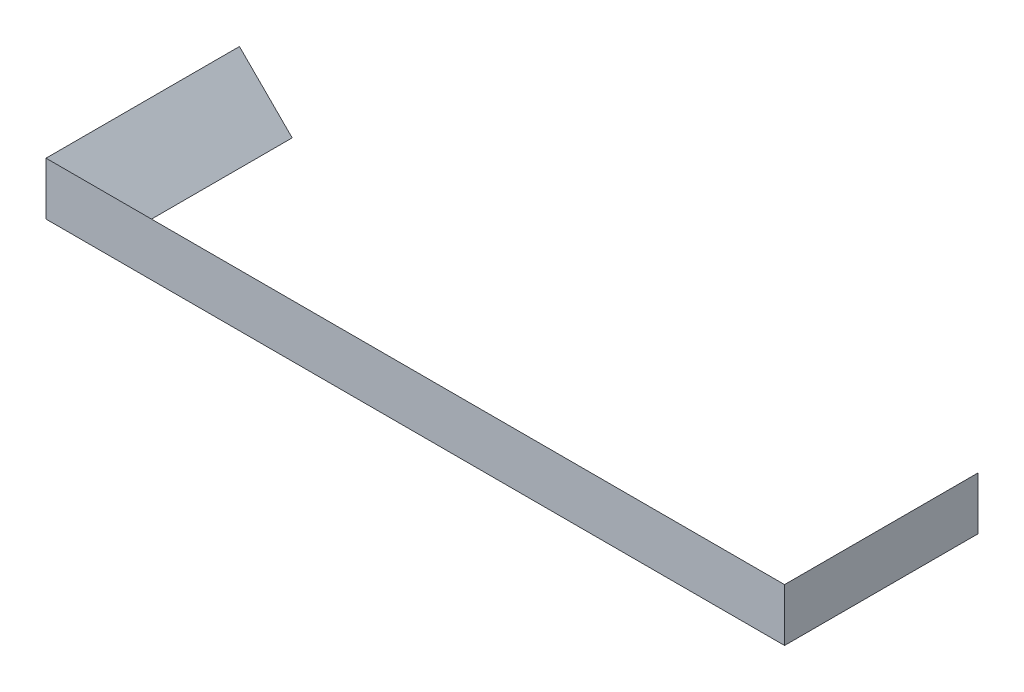
ISO-10303-21;
HEADER;
FILE_DESCRIPTION(('STEP AP214'),'2;1');
FILE_NAME('part.step','',(''),(''),'','','');
FILE_SCHEMA(('AUTOMOTIVE_DESIGN { 1 0 10303 214 1 1 1 1 }'));
ENDSEC;
DATA;
#1=APPLICATION_CONTEXT('core data for automotive mechanical design processes');
#2=APPLICATION_PROTOCOL_DEFINITION('international standard','automotive_design',2000,#1);
#3=PRODUCT_CONTEXT('',#1,'mechanical');
#4=PRODUCT('Part','Part','',(#3));
#5=PRODUCT_RELATED_PRODUCT_CATEGORY('part','',(#4));
#6=PRODUCT_DEFINITION_FORMATION('','',#4);
#7=PRODUCT_DEFINITION_CONTEXT('part definition',#1,'design');
#8=PRODUCT_DEFINITION('design','',#6,#7);
#9=PRODUCT_DEFINITION_SHAPE('','',#8);
#10=(LENGTH_UNIT() NAMED_UNIT(*) SI_UNIT(.MILLI.,.METRE.));
#11=(NAMED_UNIT(*) PLANE_ANGLE_UNIT() SI_UNIT($,.RADIAN.));
#12=(NAMED_UNIT(*) SI_UNIT($,.STERADIAN.) SOLID_ANGLE_UNIT());
#13=UNCERTAINTY_MEASURE_WITH_UNIT(LENGTH_MEASURE(1.E-05),#10,'distance_accuracy_value','');
#14=(GEOMETRIC_REPRESENTATION_CONTEXT(3) GLOBAL_UNCERTAINTY_ASSIGNED_CONTEXT((#13)) GLOBAL_UNIT_ASSIGNED_CONTEXT((#10,
#11,#12)) REPRESENTATION_CONTEXT('',''));
#15=CARTESIAN_POINT('',(0.,0.,0.));
#16=DIRECTION('',(0.,0.,1.));
#17=DIRECTION('',(1.,0.,0.));
#18=AXIS2_PLACEMENT_3D('',#15,#16,#17);
#19=CARTESIAN_POINT('',(84.,0.,22.));
#20=DIRECTION('',(-1.,0.,0.));
#21=DIRECTION('',(0.,0.,1.));
#22=AXIS2_PLACEMENT_3D('',#19,#20,#21);
#23=PLANE('',#22);
#24=DIRECTION('',(0.,-1.,0.));
#25=VECTOR('',#24,1.);
#26=CARTESIAN_POINT('',(84.,0.,0.));
#27=LINE('',#26,#25);
#28=CARTESIAN_POINT('',(84.,6.,0.));
#29=VERTEX_POINT('',#28);
#30=CARTESIAN_POINT('',(84.,0.,0.));
#31=VERTEX_POINT('',#30);
#32=EDGE_CURVE('E50',#29,#31,#27,.T.);
#33=ORIENTED_EDGE('',*,*,#32,.F.);
#34=DIRECTION('',(0.,0.,-1.));
#35=VECTOR('',#34,1.);
#36=CARTESIAN_POINT('',(84.,5.99999999999999,22.));
#37=LINE('',#36,#35);
#38=CARTESIAN_POINT('',(84.,5.99999999999999,22.));
#39=VERTEX_POINT('',#38);
#40=EDGE_CURVE('E130',#39,#29,#37,.T.);
#41=ORIENTED_EDGE('',*,*,#40,.F.);
#42=DIRECTION('',(0.,1.,0.));
#43=VECTOR('',#42,1.);
#44=CARTESIAN_POINT('',(84.,0.,22.));
#45=LINE('',#44,#43);
#46=CARTESIAN_POINT('',(84.,0.,22.));
#47=VERTEX_POINT('',#46);
#48=EDGE_CURVE('E126',#47,#39,#45,.T.);
#49=ORIENTED_EDGE('',*,*,#48,.F.);
#50=DIRECTION('',(0.,0.,-1.));
#51=VECTOR('',#50,1.);
#52=CARTESIAN_POINT('',(84.,0.,22.));
#53=LINE('',#52,#51);
#54=EDGE_CURVE('E127',#47,#31,#53,.T.);
#55=ORIENTED_EDGE('',*,*,#54,.T.);
#56=EDGE_LOOP('',(#33,#41,#49,#55));
#57=FACE_BOUND('',#56,.T.);
#58=ADVANCED_FACE('F34',(#57),#23,.F.);
#59=CARTESIAN_POINT('',(56.6094757082487,-21.3905242917513,-5.39052429175126));
#60=DIRECTION('',(0.707106781186548,-0.707106781186547,0.));
#61=DIRECTION('',(0.707106781186547,0.707106781186548,0.));
#62=AXIS2_PLACEMENT_3D('',#59,#60,#61);
#63=PLANE('',#62);
#64=DIRECTION('',(0.707106781186547,0.707106781186548,0.));
#65=VECTOR('',#64,1.);
#66=CARTESIAN_POINT('',(56.6094757082487,-21.3905242917513,0.));
#67=LINE('',#66,#65);
#68=CARTESIAN_POINT('',(78.,0.,0.));
#69=VERTEX_POINT('',#68);
#70=EDGE_CURVE('E12',#69,#29,#67,.T.);
#71=ORIENTED_EDGE('',*,*,#70,.F.);
#72=DIRECTION('',(0.,0.,-1.));
#73=VECTOR('',#72,1.);
#74=CARTESIAN_POINT('',(78.,0.,16.));
#75=LINE('',#74,#73);
#76=CARTESIAN_POINT('',(78.,0.,16.));
#77=VERTEX_POINT('',#76);
#78=EDGE_CURVE('E133',#77,#69,#75,.T.);
#79=ORIENTED_EDGE('',*,*,#78,.F.);
#80=DIRECTION('',(-0.577350269189626,-0.577350269189626,-0.577350269189626));
#81=VECTOR('',#80,1.);
#82=CARTESIAN_POINT('',(56.6094757082487,-21.3905242917513,-5.39052429175126));
#83=LINE('',#82,#81);
#84=EDGE_CURVE('E131',#39,#77,#83,.T.);
#85=ORIENTED_EDGE('',*,*,#84,.F.);
#86=ORIENTED_EDGE('',*,*,#40,.T.);
#87=EDGE_LOOP('',(#71,#79,#85,#86));
#88=FACE_BOUND('',#87,.T.);
#89=ADVANCED_FACE('F36',(#88),#63,.F.);
#90=CARTESIAN_POINT('',(0.,0.,22.));
#91=DIRECTION('',(0.,0.,1.));
#92=DIRECTION('',(1.,0.,0.));
#93=AXIS2_PLACEMENT_3D('',#90,#91,#92);
#94=PLANE('',#93);
#95=DIRECTION('',(1.,0.,0.));
#96=VECTOR('',#95,1.);
#97=CARTESIAN_POINT('',(0.,0.,22.));
#98=LINE('',#97,#96);
#99=CARTESIAN_POINT('',(0.,0.,22.));
#100=VERTEX_POINT('',#99);
#101=EDGE_CURVE('E123',#100,#47,#98,.T.);
#102=ORIENTED_EDGE('',*,*,#101,.T.);
#103=ORIENTED_EDGE('',*,*,#48,.T.);
#104=DIRECTION('',(1.,0.,0.));
#105=VECTOR('',#104,1.);
#106=CARTESIAN_POINT('',(0.,6.,22.));
#107=LINE('',#106,#105);
#108=CARTESIAN_POINT('',(0.,6.,22.));
#109=VERTEX_POINT('',#108);
#110=EDGE_CURVE('E117',#109,#39,#107,.T.);
#111=ORIENTED_EDGE('',*,*,#110,.F.);
#112=DIRECTION('',(0.,-1.,0.));
#113=VECTOR('',#112,1.);
#114=CARTESIAN_POINT('',(0.,0.,22.));
#115=LINE('',#114,#113);
#116=EDGE_CURVE('E91',#109,#100,#115,.T.);
#117=ORIENTED_EDGE('',*,*,#116,.T.);
#118=EDGE_LOOP('',(#102,#103,#111,#117));
#119=FACE_BOUND('',#118,.T.);
#120=ADVANCED_FACE('F143',(#119),#94,.T.);
#121=CARTESIAN_POINT('',(-1.82842712474618,7.82842712474619,23.8284271247462));
#122=DIRECTION('',(0.,0.707106781186547,-0.707106781186548));
#123=DIRECTION('',(0.,0.707106781186548,0.707106781186547));
#124=AXIS2_PLACEMENT_3D('',#121,#122,#123);
#125=PLANE('',#124);
#126=ORIENTED_EDGE('',*,*,#110,.T.);
#127=ORIENTED_EDGE('',*,*,#84,.T.);
#128=DIRECTION('',(1.,0.,0.));
#129=VECTOR('',#128,1.);
#130=CARTESIAN_POINT('',(6.,0.,16.));
#131=LINE('',#130,#129);
#132=CARTESIAN_POINT('',(6.,0.,16.));
#133=VERTEX_POINT('',#132);
#134=EDGE_CURVE('E120',#133,#77,#131,.T.);
#135=ORIENTED_EDGE('',*,*,#134,.F.);
#136=DIRECTION('',(-0.577350269189626,0.577350269189626,0.577350269189626));
#137=VECTOR('',#136,1.);
#138=CARTESIAN_POINT('',(-1.82842712474618,7.82842712474619,23.8284271247462));
#139=LINE('',#138,#137);
#140=EDGE_CURVE('E114',#133,#109,#139,.T.);
#141=ORIENTED_EDGE('',*,*,#140,.T.);
#142=EDGE_LOOP('',(#126,#127,#135,#141));
#143=FACE_BOUND('',#142,.T.);
#144=ADVANCED_FACE('F148',(#143),#125,.T.);
#145=CARTESIAN_POINT('',(0.,0.,27.4852813742386));
#146=DIRECTION('',(1.,0.,0.));
#147=DIRECTION('',(0.,0.,-1.));
#148=AXIS2_PLACEMENT_3D('',#145,#146,#147);
#149=PLANE('',#148);
#150=ORIENTED_EDGE('',*,*,#116,.F.);
#151=DIRECTION('',(0.,0.,-1.));
#152=VECTOR('',#151,1.);
#153=CARTESIAN_POINT('',(0.,6.,27.4852813742386));
#154=LINE('',#153,#152);
#155=CARTESIAN_POINT('',(0.,6.,0.));
#156=VERTEX_POINT('',#155);
#157=EDGE_CURVE('E84',#109,#156,#154,.T.);
#158=ORIENTED_EDGE('',*,*,#157,.T.);
#159=DIRECTION('',(0.,-1.,0.));
#160=VECTOR('',#159,1.);
#161=CARTESIAN_POINT('',(0.,0.,0.));
#162=LINE('',#161,#160);
#163=CARTESIAN_POINT('',(0.,0.,0.));
#164=VERTEX_POINT('',#163);
#165=EDGE_CURVE('E88',#156,#164,#162,.T.);
#166=ORIENTED_EDGE('',*,*,#165,.T.);
#167=DIRECTION('',(0.,0.,-1.));
#168=VECTOR('',#167,1.);
#169=CARTESIAN_POINT('',(0.,0.,27.4852813742386));
#170=LINE('',#169,#168);
#171=EDGE_CURVE('E95',#100,#164,#170,.T.);
#172=ORIENTED_EDGE('',*,*,#171,.F.);
#173=EDGE_LOOP('',(#150,#158,#166,#172));
#174=FACE_BOUND('',#173,.T.);
#175=ADVANCED_FACE('F86',(#174),#149,.F.);
#176=CARTESIAN_POINT('',(6.,0.,27.4852813742386));
#177=DIRECTION('',(0.,1.,0.));
#178=DIRECTION('',(-1.,0.,0.));
#179=AXIS2_PLACEMENT_3D('',#176,#177,#178);
#180=PLANE('',#179);
#181=DIRECTION('',(0.,0.,-1.));
#182=VECTOR('',#181,1.);
#183=CARTESIAN_POINT('',(6.,0.,27.4852813742386));
#184=LINE('',#183,#182);
#185=CARTESIAN_POINT('',(6.,0.,0.));
#186=VERTEX_POINT('',#185);
#187=EDGE_CURVE('E106',#133,#186,#184,.T.);
#188=ORIENTED_EDGE('',*,*,#187,.F.);
#189=ORIENTED_EDGE('',*,*,#134,.T.);
#190=ORIENTED_EDGE('',*,*,#78,.T.);
#191=DIRECTION('',(-1.,0.,0.));
#192=VECTOR('',#191,1.);
#193=CARTESIAN_POINT('',(42.,0.,0.));
#194=LINE('',#193,#192);
#195=EDGE_CURVE('E42',#31,#69,#194,.T.);
#196=ORIENTED_EDGE('',*,*,#195,.F.);
#197=ORIENTED_EDGE('',*,*,#54,.F.);
#198=ORIENTED_EDGE('',*,*,#101,.F.);
#199=ORIENTED_EDGE('',*,*,#171,.T.);
#200=DIRECTION('',(1.,0.,0.));
#201=VECTOR('',#200,1.);
#202=CARTESIAN_POINT('',(6.,0.,0.));
#203=LINE('',#202,#201);
#204=EDGE_CURVE('E102',#164,#186,#203,.T.);
#205=ORIENTED_EDGE('',*,*,#204,.T.);
#206=EDGE_LOOP('',(#188,#189,#190,#196,#197,#198,#199,#205));
#207=FACE_BOUND('',#206,.T.);
#208=ADVANCED_FACE('F149',(#207),#180,.F.);
#209=CARTESIAN_POINT('',(0.,6.,27.4852813742386));
#210=DIRECTION('',(-0.707106781186547,-0.707106781186547,0.));
#211=DIRECTION('',(0.707106781186548,-0.707106781186548,0.));
#212=AXIS2_PLACEMENT_3D('',#209,#210,#211);
#213=PLANE('',#212);
#214=ORIENTED_EDGE('',*,*,#140,.F.);
#215=ORIENTED_EDGE('',*,*,#187,.T.);
#216=DIRECTION('',(-0.707106781186548,0.707106781186548,0.));
#217=VECTOR('',#216,1.);
#218=CARTESIAN_POINT('',(0.,6.,0.));
#219=LINE('',#218,#217);
#220=EDGE_CURVE('E100',#186,#156,#219,.T.);
#221=ORIENTED_EDGE('',*,*,#220,.T.);
#222=ORIENTED_EDGE('',*,*,#157,.F.);
#223=EDGE_LOOP('',(#214,#215,#221,#222));
#224=FACE_BOUND('',#223,.T.);
#225=ADVANCED_FACE('F104',(#224),#213,.F.);
#226=CARTESIAN_POINT('',(6.,0.,0.));
#227=DIRECTION('',(0.,0.,-1.));
#228=DIRECTION('',(-1.,0.,0.));
#229=AXIS2_PLACEMENT_3D('',#226,#227,#228);
#230=PLANE('',#229);
#231=ORIENTED_EDGE('',*,*,#220,.F.);
#232=ORIENTED_EDGE('',*,*,#204,.F.);
#233=ORIENTED_EDGE('',*,*,#165,.F.);
#234=EDGE_LOOP('',(#231,#232,#233));
#235=FACE_BOUND('',#234,.T.);
#236=ADVANCED_FACE('F99',(#235),#230,.T.);
#237=CARTESIAN_POINT('',(81.,3.,0.));
#238=DIRECTION('',(0.,0.,-1.));
#239=DIRECTION('',(-1.,0.,0.));
#240=AXIS2_PLACEMENT_3D('',#237,#238,#239);
#241=PLANE('',#240);
#242=ORIENTED_EDGE('',*,*,#195,.T.);
#243=ORIENTED_EDGE('',*,*,#70,.T.);
#244=ORIENTED_EDGE('',*,*,#32,.T.);
#245=EDGE_LOOP('',(#242,#243,#244));
#246=FACE_BOUND('',#245,.T.);
#247=ADVANCED_FACE('F150',(#246),#241,.T.);
#248=CLOSED_SHELL('',(#58,#89,#120,#144,#175,#208,#225,#236,#247));
#249=MANIFOLD_SOLID_BREP('B2',#248);
#250=ADVANCED_BREP_SHAPE_REPRESENTATION('',(#18,#249),#14);
#251=SHAPE_DEFINITION_REPRESENTATION(#9,#250);
ENDSEC;
END-ISO-10303-21;
